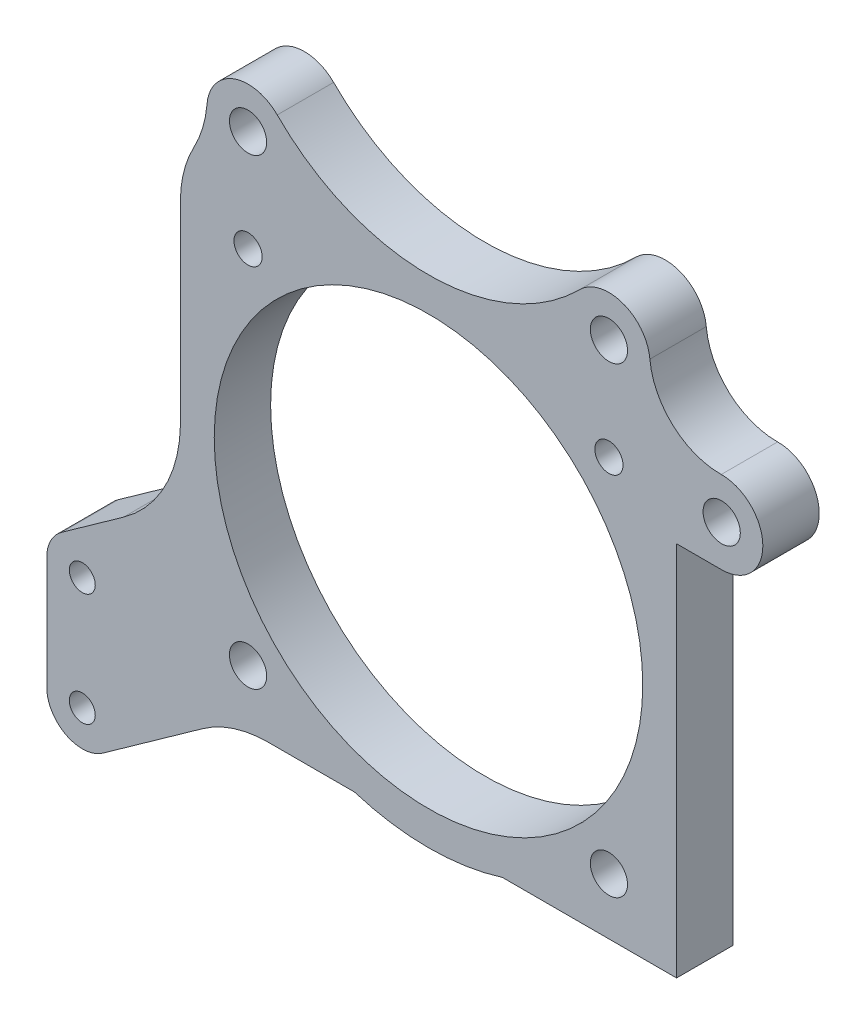
ISO-10303-21;
HEADER;
FILE_DESCRIPTION(('STEP AP214'),'2;1');
FILE_NAME('part.step','',(''),(''),'','','');
FILE_SCHEMA(('AUTOMOTIVE_DESIGN { 1 0 10303 214 1 1 1 1 }'));
ENDSEC;
DATA;
#1=APPLICATION_CONTEXT('core data for automotive mechanical design processes');
#2=APPLICATION_PROTOCOL_DEFINITION('international standard','automotive_design',2000,#1);
#3=PRODUCT_CONTEXT('',#1,'mechanical');
#4=PRODUCT('Part','Part','',(#3));
#5=PRODUCT_RELATED_PRODUCT_CATEGORY('part','',(#4));
#6=PRODUCT_DEFINITION_FORMATION('','',#4);
#7=PRODUCT_DEFINITION_CONTEXT('part definition',#1,'design');
#8=PRODUCT_DEFINITION('design','',#6,#7);
#9=PRODUCT_DEFINITION_SHAPE('','',#8);
#10=(LENGTH_UNIT() NAMED_UNIT(*) SI_UNIT(.MILLI.,.METRE.));
#11=(NAMED_UNIT(*) PLANE_ANGLE_UNIT() SI_UNIT($,.RADIAN.));
#12=(NAMED_UNIT(*) SI_UNIT($,.STERADIAN.) SOLID_ANGLE_UNIT());
#13=UNCERTAINTY_MEASURE_WITH_UNIT(LENGTH_MEASURE(1.E-05),#10,'distance_accuracy_value','');
#14=(GEOMETRIC_REPRESENTATION_CONTEXT(3) GLOBAL_UNCERTAINTY_ASSIGNED_CONTEXT((#13)) GLOBAL_UNIT_ASSIGNED_CONTEXT((#10,
#11,#12)) REPRESENTATION_CONTEXT('',''));
#15=CARTESIAN_POINT('',(0.,0.,0.));
#16=DIRECTION('',(0.,0.,1.));
#17=DIRECTION('',(1.,0.,0.));
#18=AXIS2_PLACEMENT_3D('',#15,#16,#17);
#19=CARTESIAN_POINT('',(-20.2380952380952,-21.,45.7173028644093));
#20=DIRECTION('',(-1.,0.,0.));
#21=DIRECTION('',(0.,0.,1.));
#22=AXIS2_PLACEMENT_3D('',#19,#20,#21);
#23=PLANE('',#22);
#24=DIRECTION('',(0.,1.,0.));
#25=VECTOR('',#24,1.);
#26=CARTESIAN_POINT('',(-20.2380952380952,-21.,0.));
#27=LINE('',#26,#25);
#28=CARTESIAN_POINT('',(-20.2380952380952,-0.558456175241286,0.));
#29=VERTEX_POINT('',#28);
#30=CARTESIAN_POINT('',(-20.2380952380952,16.6503890181125,0.));
#31=VERTEX_POINT('',#30);
#32=EDGE_CURVE('E258',#29,#31,#27,.T.);
#33=ORIENTED_EDGE('',*,*,#32,.F.);
#34=DIRECTION('',(0.,0.,1.));
#35=VECTOR('',#34,1.);
#36=CARTESIAN_POINT('',(-20.2380952380952,-0.558456175241278,-35.1845806434157));
#37=LINE('',#36,#35);
#38=CARTESIAN_POINT('',(-20.2380952380952,-0.558456175241278,5.));
#39=VERTEX_POINT('',#38);
#40=EDGE_CURVE('E58',#29,#39,#37,.T.);
#41=ORIENTED_EDGE('',*,*,#40,.T.);
#42=DIRECTION('',(0.,1.,0.));
#43=VECTOR('',#42,1.);
#44=CARTESIAN_POINT('',(-20.2380952380952,-21.,5.));
#45=LINE('',#44,#43);
#46=CARTESIAN_POINT('',(-20.2380952380952,16.6503890181126,5.));
#47=VERTEX_POINT('',#46);
#48=EDGE_CURVE('E260',#39,#47,#45,.T.);
#49=ORIENTED_EDGE('',*,*,#48,.T.);
#50=DIRECTION('',(0.,0.,-1.));
#51=VECTOR('',#50,1.);
#52=CARTESIAN_POINT('',(-20.2380952380952,16.6503890181126,0.));
#53=LINE('',#52,#51);
#54=EDGE_CURVE('E391',#47,#31,#53,.T.);
#55=ORIENTED_EDGE('',*,*,#54,.T.);
#56=EDGE_LOOP('',(#33,#41,#49,#55));
#57=FACE_BOUND('',#56,.T.);
#58=ADVANCED_FACE('F43',(#57),#23,.T.);
#59=CARTESIAN_POINT('',(-17.8880952380952,-21.,17.));
#60=DIRECTION('',(0.,1.,0.));
#61=DIRECTION('',(0.,0.,1.));
#62=AXIS2_PLACEMENT_3D('',#59,#60,#61);
#63=PLANE('',#62);
#64=DIRECTION('',(1.,0.,0.));
#65=VECTOR('',#64,1.);
#66=CARTESIAN_POINT('',(-17.8880952380952,-21.,5.));
#67=LINE('',#66,#65);
#68=CARTESIAN_POINT('',(-12.4460870876995,-21.,5.));
#69=VERTEX_POINT('',#68);
#70=CARTESIAN_POINT('',(-4.79553376239723,-21.,5.));
#71=VERTEX_POINT('',#70);
#72=EDGE_CURVE('E305',#69,#71,#67,.T.);
#73=ORIENTED_EDGE('',*,*,#72,.F.);
#74=DIRECTION('',(0.,0.,1.));
#75=VECTOR('',#74,1.);
#76=CARTESIAN_POINT('',(-12.4460870876995,-21.,-35.1845806434157));
#77=LINE('',#76,#75);
#78=CARTESIAN_POINT('',(-12.4460870876995,-21.,0.));
#79=VERTEX_POINT('',#78);
#80=EDGE_CURVE('E244',#79,#69,#77,.T.);
#81=ORIENTED_EDGE('',*,*,#80,.F.);
#82=DIRECTION('',(1.,0.,0.));
#83=VECTOR('',#82,1.);
#84=CARTESIAN_POINT('',(-17.8880952380952,-21.,0.));
#85=LINE('',#84,#83);
#86=CARTESIAN_POINT('',(-4.79553376239723,-21.,0.));
#87=VERTEX_POINT('',#86);
#88=EDGE_CURVE('E334',#79,#87,#85,.T.);
#89=ORIENTED_EDGE('',*,*,#88,.T.);
#90=DIRECTION('',(0.,0.,-1.));
#91=VECTOR('',#90,1.);
#92=CARTESIAN_POINT('',(-4.79553376239723,-21.,17.));
#93=LINE('',#92,#91);
#94=EDGE_CURVE('E380',#71,#87,#93,.T.);
#95=ORIENTED_EDGE('',*,*,#94,.F.);
#96=EDGE_LOOP('',(#73,#81,#89,#95));
#97=FACE_BOUND('',#96,.T.);
#98=ADVANCED_FACE('F455',(#97),#63,.F.);
#99=CARTESIAN_POINT('',(8.31934328620676,-21.,17.));
#100=DIRECTION('',(0.,1.,0.));
#101=DIRECTION('',(0.,0.,1.));
#102=AXIS2_PLACEMENT_3D('',#99,#100,#101);
#103=PLANE('',#102);
#104=DIRECTION('',(0.,0.,-1.));
#105=VECTOR('',#104,1.);
#106=CARTESIAN_POINT('',(23.7619047619048,-21.,17.));
#107=LINE('',#106,#105);
#108=CARTESIAN_POINT('',(23.7619047619048,-21.,5.));
#109=VERTEX_POINT('',#108);
#110=CARTESIAN_POINT('',(23.7619047619048,-21.,0.));
#111=VERTEX_POINT('',#110);
#112=EDGE_CURVE('E376',#109,#111,#107,.T.);
#113=ORIENTED_EDGE('',*,*,#112,.F.);
#114=DIRECTION('',(1.,0.,0.));
#115=VECTOR('',#114,1.);
#116=CARTESIAN_POINT('',(8.31934328620676,-21.,5.));
#117=LINE('',#116,#115);
#118=CARTESIAN_POINT('',(8.31934328620676,-21.,5.));
#119=VERTEX_POINT('',#118);
#120=EDGE_CURVE('E301',#119,#109,#117,.T.);
#121=ORIENTED_EDGE('',*,*,#120,.F.);
#122=DIRECTION('',(0.,0.,-1.));
#123=VECTOR('',#122,1.);
#124=CARTESIAN_POINT('',(8.31934328620676,-21.,17.));
#125=LINE('',#124,#123);
#126=CARTESIAN_POINT('',(8.31934328620676,-21.,0.));
#127=VERTEX_POINT('',#126);
#128=EDGE_CURVE('E378',#119,#127,#125,.T.);
#129=ORIENTED_EDGE('',*,*,#128,.T.);
#130=DIRECTION('',(1.,0.,0.));
#131=VECTOR('',#130,1.);
#132=CARTESIAN_POINT('',(8.31934328620676,-21.,0.));
#133=LINE('',#132,#131);
#134=EDGE_CURVE('E340',#127,#111,#133,.T.);
#135=ORIENTED_EDGE('',*,*,#134,.T.);
#136=EDGE_LOOP('',(#113,#121,#129,#135));
#137=FACE_BOUND('',#136,.T.);
#138=ADVANCED_FACE('F446',(#137),#103,.F.);
#139=CARTESIAN_POINT('',(23.7619047619048,-21.,17.));
#140=DIRECTION('',(-1.,0.,0.));
#141=DIRECTION('',(0.,-1.,0.));
#142=AXIS2_PLACEMENT_3D('',#139,#140,#141);
#143=PLANE('',#142);
#144=DIRECTION('',(0.,1.,0.));
#145=VECTOR('',#144,1.);
#146=CARTESIAN_POINT('',(23.7619047619048,-21.,5.));
#147=LINE('',#146,#145);
#148=CARTESIAN_POINT('',(23.7619047619048,12.35,5.));
#149=VERTEX_POINT('',#148);
#150=EDGE_CURVE('E262',#109,#149,#147,.T.);
#151=ORIENTED_EDGE('',*,*,#150,.F.);
#152=ORIENTED_EDGE('',*,*,#112,.T.);
#153=DIRECTION('',(0.,1.,0.));
#154=VECTOR('',#153,1.);
#155=CARTESIAN_POINT('',(23.7619047619048,-21.,0.));
#156=LINE('',#155,#154);
#157=CARTESIAN_POINT('',(23.7619047619048,12.35,0.));
#158=VERTEX_POINT('',#157);
#159=EDGE_CURVE('E343',#111,#158,#156,.T.);
#160=ORIENTED_EDGE('',*,*,#159,.T.);
#161=DIRECTION('',(0.,0.,-1.));
#162=VECTOR('',#161,1.);
#163=CARTESIAN_POINT('',(23.7619047619048,12.35,17.));
#164=LINE('',#163,#162);
#165=EDGE_CURVE('E374',#149,#158,#164,.T.);
#166=ORIENTED_EDGE('',*,*,#165,.F.);
#167=EDGE_LOOP('',(#151,#152,#160,#166));
#168=FACE_BOUND('',#167,.T.);
#169=ADVANCED_FACE('F442',(#168),#143,.F.);
#170=CARTESIAN_POINT('',(1.76190476190476,0.,17.));
#171=DIRECTION('',(0.,0.,-1.));
#172=DIRECTION('',(-1.,0.,0.));
#173=AXIS2_PLACEMENT_3D('',#170,#171,#172);
#174=CYLINDRICAL_SURFACE('',#173,22.);
#175=CARTESIAN_POINT('',(1.76190476190476,0.,5.));
#176=DIRECTION('',(0.,0.,1.));
#177=DIRECTION('',(1.,0.,0.));
#178=AXIS2_PLACEMENT_3D('',#175,#176,#177);
#179=CIRCLE('',#178,22.);
#180=EDGE_CURVE('E303',#71,#119,#179,.T.);
#181=ORIENTED_EDGE('',*,*,#180,.F.);
#182=ORIENTED_EDGE('',*,*,#94,.T.);
#183=CARTESIAN_POINT('',(1.76190476190476,0.,0.));
#184=DIRECTION('',(0.,0.,1.));
#185=DIRECTION('',(1.,0.,0.));
#186=AXIS2_PLACEMENT_3D('',#183,#184,#185);
#187=CIRCLE('',#186,22.);
#188=EDGE_CURVE('E337',#87,#127,#187,.T.);
#189=ORIENTED_EDGE('',*,*,#188,.T.);
#190=ORIENTED_EDGE('',*,*,#128,.F.);
#191=EDGE_LOOP('',(#181,#182,#189,#190));
#192=FACE_BOUND('',#191,.T.);
#193=ADVANCED_FACE('F451',(#192),#174,.T.);
#194=CARTESIAN_POINT('',(23.7619047619048,12.35,17.));
#195=DIRECTION('',(0.,1.,0.));
#196=DIRECTION('',(0.,0.,1.));
#197=AXIS2_PLACEMENT_3D('',#194,#195,#196);
#198=PLANE('',#197);
#199=DIRECTION('',(1.,0.,0.));
#200=VECTOR('',#199,1.);
#201=CARTESIAN_POINT('',(23.7619047619048,12.35,5.));
#202=LINE('',#201,#200);
#203=CARTESIAN_POINT('',(27.7619047619048,12.35,5.));
#204=VERTEX_POINT('',#203);
#205=EDGE_CURVE('E299',#149,#204,#202,.T.);
#206=ORIENTED_EDGE('',*,*,#205,.F.);
#207=ORIENTED_EDGE('',*,*,#165,.T.);
#208=DIRECTION('',(1.,0.,0.));
#209=VECTOR('',#208,1.);
#210=CARTESIAN_POINT('',(23.7619047619048,12.35,0.));
#211=LINE('',#210,#209);
#212=CARTESIAN_POINT('',(27.7619047619048,12.35,0.));
#213=VERTEX_POINT('',#212);
#214=EDGE_CURVE('E346',#158,#213,#211,.T.);
#215=ORIENTED_EDGE('',*,*,#214,.T.);
#216=DIRECTION('',(0.,0.,-1.));
#217=VECTOR('',#216,1.);
#218=CARTESIAN_POINT('',(27.7619047619048,12.35,17.));
#219=LINE('',#218,#217);
#220=EDGE_CURVE('E372',#204,#213,#219,.T.);
#221=ORIENTED_EDGE('',*,*,#220,.F.);
#222=EDGE_LOOP('',(#206,#207,#215,#221));
#223=FACE_BOUND('',#222,.T.);
#224=ADVANCED_FACE('F438',(#223),#198,.F.);
#225=CARTESIAN_POINT('',(27.7619047619048,16.,17.));
#226=DIRECTION('',(0.,0.,-1.));
#227=DIRECTION('',(-1.,0.,0.));
#228=AXIS2_PLACEMENT_3D('',#225,#226,#227);
#229=CYLINDRICAL_SURFACE('',#228,3.65);
#230=CARTESIAN_POINT('',(27.7619047619048,16.,5.));
#231=DIRECTION('',(0.,0.,1.));
#232=DIRECTION('',(1.,0.,0.));
#233=AXIS2_PLACEMENT_3D('',#230,#231,#232);
#234=CIRCLE('',#233,3.65);
#235=CARTESIAN_POINT('',(27.7228519117956,19.6497910727737,5.));
#236=VERTEX_POINT('',#235);
#237=EDGE_CURVE('E297',#204,#236,#234,.T.);
#238=ORIENTED_EDGE('',*,*,#237,.F.);
#239=ORIENTED_EDGE('',*,*,#220,.T.);
#240=CARTESIAN_POINT('',(27.7619047619048,16.,0.));
#241=DIRECTION('',(0.,0.,1.));
#242=DIRECTION('',(-1.,0.,0.));
#243=AXIS2_PLACEMENT_3D('',#240,#241,#242);
#244=CIRCLE('',#243,3.65);
#245=CARTESIAN_POINT('',(27.7228519117956,19.6497910727737,0.));
#246=VERTEX_POINT('',#245);
#247=EDGE_CURVE('E349',#213,#246,#244,.T.);
#248=ORIENTED_EDGE('',*,*,#247,.T.);
#249=DIRECTION('',(0.,0.,-1.));
#250=VECTOR('',#249,1.);
#251=CARTESIAN_POINT('',(27.7228519117956,19.6497910727737,17.));
#252=LINE('',#251,#250);
#253=EDGE_CURVE('E370',#236,#246,#252,.T.);
#254=ORIENTED_EDGE('',*,*,#253,.F.);
#255=EDGE_LOOP('',(#238,#239,#248,#254));
#256=FACE_BOUND('',#255,.T.);
#257=ADVANCED_FACE('F431',(#256),#229,.T.);
#258=CARTESIAN_POINT('',(27.6555742361179,25.9374105269034,17.));
#259=DIRECTION('',(0.,0.,-1.));
#260=DIRECTION('',(-1.,0.,0.));
#261=AXIS2_PLACEMENT_3D('',#258,#259,#260);
#262=CYLINDRICAL_SURFACE('',#261,6.28797938018214);
#263=DIRECTION('',(0.,0.,-1.));
#264=VECTOR('',#263,1.);
#265=CARTESIAN_POINT('',(21.3956307135696,25.3442901511771,17.));
#266=LINE('',#265,#264);
#267=CARTESIAN_POINT('',(21.3956307135696,25.3442901511771,5.));
#268=VERTEX_POINT('',#267);
#269=CARTESIAN_POINT('',(21.3956307135696,25.3442901511771,0.));
#270=VERTEX_POINT('',#269);
#271=EDGE_CURVE('E368',#268,#270,#266,.T.);
#272=ORIENTED_EDGE('',*,*,#271,.F.);
#273=CARTESIAN_POINT('',(27.6555742361179,25.9374105269034,5.));
#274=DIRECTION('',(0.,0.,1.));
#275=DIRECTION('',(1.,0.,0.));
#276=AXIS2_PLACEMENT_3D('',#273,#274,#275);
#277=CIRCLE('',#276,6.28797938018214);
#278=EDGE_CURVE('E295',#236,#268,#277,.F.);
#279=ORIENTED_EDGE('',*,*,#278,.F.);
#280=ORIENTED_EDGE('',*,*,#253,.T.);
#281=CARTESIAN_POINT('',(27.6555742361179,25.9374105269034,0.));
#282=DIRECTION('',(0.,0.,-1.));
#283=DIRECTION('',(-1.,0.,0.));
#284=AXIS2_PLACEMENT_3D('',#281,#282,#283);
#285=CIRCLE('',#284,6.28797938018214);
#286=EDGE_CURVE('E352',#246,#270,#285,.T.);
#287=ORIENTED_EDGE('',*,*,#286,.T.);
#288=EDGE_LOOP('',(#272,#279,#280,#287));
#289=FACE_BOUND('',#288,.T.);
#290=ADVANCED_FACE('F427',(#289),#262,.F.);
#291=CARTESIAN_POINT('',(17.7619047619048,25.,17.));
#292=DIRECTION('',(0.,0.,-1.));
#293=DIRECTION('',(-1.,0.,0.));
#294=AXIS2_PLACEMENT_3D('',#291,#292,#293);
#295=CYLINDRICAL_SURFACE('',#294,3.65);
#296=CARTESIAN_POINT('',(17.7619047619048,25.,5.));
#297=DIRECTION('',(0.,0.,1.));
#298=DIRECTION('',(1.,0.,0.));
#299=AXIS2_PLACEMENT_3D('',#296,#297,#298);
#300=CIRCLE('',#299,3.65);
#301=CARTESIAN_POINT('',(15.1747568965716,27.5747166684709,5.));
#302=VERTEX_POINT('',#301);
#303=EDGE_CURVE('E293',#268,#302,#300,.T.);
#304=ORIENTED_EDGE('',*,*,#303,.F.);
#305=ORIENTED_EDGE('',*,*,#271,.T.);
#306=CARTESIAN_POINT('',(17.7619047619048,25.,0.));
#307=DIRECTION('',(0.,0.,1.));
#308=DIRECTION('',(-1.,0.,0.));
#309=AXIS2_PLACEMENT_3D('',#306,#307,#308);
#310=CIRCLE('',#309,3.65);
#311=CARTESIAN_POINT('',(15.1747568965716,27.5747166684709,0.));
#312=VERTEX_POINT('',#311);
#313=EDGE_CURVE('E355',#270,#312,#310,.T.);
#314=ORIENTED_EDGE('',*,*,#313,.T.);
#315=DIRECTION('',(0.,0.,-1.));
#316=VECTOR('',#315,1.);
#317=CARTESIAN_POINT('',(15.1747568965716,27.5747166684709,17.));
#318=LINE('',#317,#316);
#319=EDGE_CURVE('E366',#302,#312,#318,.T.);
#320=ORIENTED_EDGE('',*,*,#319,.F.);
#321=EDGE_LOOP('',(#304,#305,#314,#320));
#322=FACE_BOUND('',#321,.T.);
#323=ADVANCED_FACE('F423',(#322),#295,.T.);
#324=CARTESIAN_POINT('',(1.76190476190476,40.9231203007519,17.));
#325=DIRECTION('',(0.,0.,-1.));
#326=DIRECTION('',(-1.,0.,0.));
#327=AXIS2_PLACEMENT_3D('',#324,#325,#326);
#328=CYLINDRICAL_SURFACE('',#327,18.9231203007519);
#329=CARTESIAN_POINT('',(1.76190476190476,40.9231203007519,5.));
#330=DIRECTION('',(0.,0.,1.));
#331=DIRECTION('',(1.,0.,0.));
#332=AXIS2_PLACEMENT_3D('',#329,#330,#331);
#333=CIRCLE('',#332,18.9231203007519);
#334=CARTESIAN_POINT('',(-11.650947372762,27.5747166684709,5.));
#335=VERTEX_POINT('',#334);
#336=EDGE_CURVE('E291',#302,#335,#333,.F.);
#337=ORIENTED_EDGE('',*,*,#336,.F.);
#338=ORIENTED_EDGE('',*,*,#319,.T.);
#339=CARTESIAN_POINT('',(1.76190476190476,40.9231203007519,0.));
#340=DIRECTION('',(0.,0.,-1.));
#341=DIRECTION('',(-1.,0.,0.));
#342=AXIS2_PLACEMENT_3D('',#339,#340,#341);
#343=CIRCLE('',#342,18.9231203007519);
#344=CARTESIAN_POINT('',(-11.650947372762,27.5747166684709,0.));
#345=VERTEX_POINT('',#344);
#346=EDGE_CURVE('E358',#312,#345,#343,.T.);
#347=ORIENTED_EDGE('',*,*,#346,.T.);
#348=DIRECTION('',(0.,0.,-1.));
#349=VECTOR('',#348,1.);
#350=CARTESIAN_POINT('',(-11.650947372762,27.5747166684709,17.));
#351=LINE('',#350,#349);
#352=EDGE_CURVE('E364',#335,#345,#351,.T.);
#353=ORIENTED_EDGE('',*,*,#352,.F.);
#354=EDGE_LOOP('',(#337,#338,#347,#353));
#355=FACE_BOUND('',#354,.T.);
#356=ADVANCED_FACE('F415',(#355),#328,.F.);
#357=CARTESIAN_POINT('',(-14.2380952380952,25.,17.));
#358=DIRECTION('',(0.,0.,-1.));
#359=DIRECTION('',(-1.,0.,0.));
#360=AXIS2_PLACEMENT_3D('',#357,#358,#359);
#361=CYLINDRICAL_SURFACE('',#360,3.65);
#362=CARTESIAN_POINT('',(-14.2380952380952,25.,0.));
#363=DIRECTION('',(0.,0.,1.));
#364=DIRECTION('',(-1.,0.,0.));
#365=AXIS2_PLACEMENT_3D('',#362,#363,#364);
#366=CIRCLE('',#365,3.65);
#367=CARTESIAN_POINT('',(-17.8751950900905,25.3066018046526,0.));
#368=VERTEX_POINT('',#367);
#369=EDGE_CURVE('E361',#345,#368,#366,.T.);
#370=ORIENTED_EDGE('',*,*,#369,.T.);
#371=DIRECTION('',(0.,0.,-1.));
#372=VECTOR('',#371,1.);
#373=CARTESIAN_POINT('',(-17.8751950900905,25.3066018046526,17.));
#374=LINE('',#373,#372);
#375=CARTESIAN_POINT('',(-17.8751950900905,25.3066018046526,5.));
#376=VERTEX_POINT('',#375);
#377=EDGE_CURVE('E383',#368,#376,#374,.F.);
#378=ORIENTED_EDGE('',*,*,#377,.T.);
#379=CARTESIAN_POINT('',(-14.2380952380952,25.,5.));
#380=DIRECTION('',(0.,0.,1.));
#381=DIRECTION('',(1.,0.,0.));
#382=AXIS2_PLACEMENT_3D('',#379,#380,#381);
#383=CIRCLE('',#382,3.65);
#384=EDGE_CURVE('E288',#335,#376,#383,.T.);
#385=ORIENTED_EDGE('',*,*,#384,.F.);
#386=ORIENTED_EDGE('',*,*,#352,.T.);
#387=EDGE_LOOP('',(#370,#378,#385,#386));
#388=FACE_BOUND('',#387,.T.);
#389=ADVANCED_FACE('F413',(#388),#361,.T.);
#390=CARTESIAN_POINT('',(1.76190476190476,0.,17.));
#391=DIRECTION('',(0.,0.,-1.));
#392=DIRECTION('',(-1.,0.,0.));
#393=AXIS2_PLACEMENT_3D('',#390,#391,#392);
#394=CYLINDRICAL_SURFACE('',#393,19.);
#395=CARTESIAN_POINT('',(1.76190476190476,0.,0.));
#396=DIRECTION('',(0.,0.,1.));
#397=DIRECTION('',(1.,0.,0.));
#398=AXIS2_PLACEMENT_3D('',#395,#396,#397);
#399=CIRCLE('',#398,19.);
#400=CARTESIAN_POINT('',(20.7619047619048,0.,0.));
#401=VERTEX_POINT('',#400);
#402=EDGE_CURVE('E330',#401,#401,#399,.T.);
#403=ORIENTED_EDGE('',*,*,#402,.F.);
#404=EDGE_LOOP('',(#403));
#405=FACE_BOUND('',#404,.T.);
#406=CARTESIAN_POINT('',(1.76190476190476,0.,5.));
#407=DIRECTION('',(0.,0.,1.));
#408=DIRECTION('',(1.,0.,0.));
#409=AXIS2_PLACEMENT_3D('',#406,#407,#408);
#410=CIRCLE('',#409,19.);
#411=CARTESIAN_POINT('',(20.7619047619048,0.,5.));
#412=VERTEX_POINT('',#411);
#413=EDGE_CURVE('E284',#412,#412,#410,.T.);
#414=ORIENTED_EDGE('',*,*,#413,.T.);
#415=EDGE_LOOP('',(#414));
#416=FACE_BOUND('',#415,.T.);
#417=ADVANCED_FACE('F628',(#405,#416),#394,.F.);
#418=CARTESIAN_POINT('',(17.7619047619048,16.,17.));
#419=DIRECTION('',(0.,0.,-1.));
#420=DIRECTION('',(-1.,0.,0.));
#421=AXIS2_PLACEMENT_3D('',#418,#419,#420);
#422=CYLINDRICAL_SURFACE('',#421,1.25);
#423=CARTESIAN_POINT('',(17.7619047619048,16.,0.));
#424=DIRECTION('',(0.,0.,1.));
#425=DIRECTION('',(1.,0.,0.));
#426=AXIS2_PLACEMENT_3D('',#423,#424,#425);
#427=CIRCLE('',#426,1.25);
#428=CARTESIAN_POINT('',(19.0119047619048,16.,0.));
#429=VERTEX_POINT('',#428);
#430=EDGE_CURVE('E327',#429,#429,#427,.T.);
#431=ORIENTED_EDGE('',*,*,#430,.F.);
#432=EDGE_LOOP('',(#431));
#433=FACE_BOUND('',#432,.T.);
#434=CARTESIAN_POINT('',(17.7619047619048,16.,5.));
#435=DIRECTION('',(0.,0.,1.));
#436=DIRECTION('',(1.,0.,0.));
#437=AXIS2_PLACEMENT_3D('',#434,#435,#436);
#438=CIRCLE('',#437,1.25);
#439=CARTESIAN_POINT('',(19.0119047619048,16.,5.));
#440=VERTEX_POINT('',#439);
#441=EDGE_CURVE('E281',#440,#440,#438,.T.);
#442=ORIENTED_EDGE('',*,*,#441,.T.);
#443=EDGE_LOOP('',(#442));
#444=FACE_BOUND('',#443,.T.);
#445=ADVANCED_FACE('F639',(#433,#444),#422,.F.);
#446=CARTESIAN_POINT('',(-14.2380952380952,16.,17.));
#447=DIRECTION('',(0.,0.,-1.));
#448=DIRECTION('',(-1.,0.,0.));
#449=AXIS2_PLACEMENT_3D('',#446,#447,#448);
#450=CYLINDRICAL_SURFACE('',#449,1.25);
#451=CARTESIAN_POINT('',(-14.2380952380952,16.,0.));
#452=DIRECTION('',(0.,0.,1.));
#453=DIRECTION('',(1.,0.,0.));
#454=AXIS2_PLACEMENT_3D('',#451,#452,#453);
#455=CIRCLE('',#454,1.25);
#456=CARTESIAN_POINT('',(-12.9880952380952,16.,0.));
#457=VERTEX_POINT('',#456);
#458=EDGE_CURVE('E324',#457,#457,#455,.T.);
#459=ORIENTED_EDGE('',*,*,#458,.F.);
#460=EDGE_LOOP('',(#459));
#461=FACE_BOUND('',#460,.T.);
#462=CARTESIAN_POINT('',(-14.2380952380952,16.,5.));
#463=DIRECTION('',(0.,0.,1.));
#464=DIRECTION('',(1.,0.,0.));
#465=AXIS2_PLACEMENT_3D('',#462,#463,#464);
#466=CIRCLE('',#465,1.25);
#467=CARTESIAN_POINT('',(-12.9880952380952,16.,5.));
#468=VERTEX_POINT('',#467);
#469=EDGE_CURVE('E278',#468,#468,#466,.T.);
#470=ORIENTED_EDGE('',*,*,#469,.T.);
#471=EDGE_LOOP('',(#470));
#472=FACE_BOUND('',#471,.T.);
#473=ADVANCED_FACE('F730',(#461,#472),#450,.F.);
#474=CARTESIAN_POINT('',(-14.2380952380952,-16.,17.));
#475=DIRECTION('',(0.,0.,-1.));
#476=DIRECTION('',(-1.,0.,0.));
#477=AXIS2_PLACEMENT_3D('',#474,#475,#476);
#478=CYLINDRICAL_SURFACE('',#477,1.65);
#479=CARTESIAN_POINT('',(-14.2380952380952,-16.,0.));
#480=DIRECTION('',(0.,0.,1.));
#481=DIRECTION('',(1.,0.,0.));
#482=AXIS2_PLACEMENT_3D('',#479,#480,#481);
#483=CIRCLE('',#482,1.65);
#484=CARTESIAN_POINT('',(-12.5880952380952,-16.,0.));
#485=VERTEX_POINT('',#484);
#486=EDGE_CURVE('E320',#485,#485,#483,.T.);
#487=ORIENTED_EDGE('',*,*,#486,.F.);
#488=EDGE_LOOP('',(#487));
#489=FACE_BOUND('',#488,.T.);
#490=CARTESIAN_POINT('',(-14.2380952380952,-16.,5.));
#491=DIRECTION('',(0.,0.,1.));
#492=DIRECTION('',(1.,0.,0.));
#493=AXIS2_PLACEMENT_3D('',#490,#491,#492);
#494=CIRCLE('',#493,1.65);
#495=CARTESIAN_POINT('',(-12.5880952380952,-16.,5.));
#496=VERTEX_POINT('',#495);
#497=EDGE_CURVE('E274',#496,#496,#494,.T.);
#498=ORIENTED_EDGE('',*,*,#497,.T.);
#499=EDGE_LOOP('',(#498));
#500=FACE_BOUND('',#499,.T.);
#501=ADVANCED_FACE('F720',(#489,#500),#478,.F.);
#502=CARTESIAN_POINT('',(17.7619047619048,-16.,17.));
#503=DIRECTION('',(0.,0.,-1.));
#504=DIRECTION('',(-1.,0.,0.));
#505=AXIS2_PLACEMENT_3D('',#502,#503,#504);
#506=CYLINDRICAL_SURFACE('',#505,1.65);
#507=CARTESIAN_POINT('',(17.7619047619048,-16.,0.));
#508=DIRECTION('',(0.,0.,1.));
#509=DIRECTION('',(1.,0.,0.));
#510=AXIS2_PLACEMENT_3D('',#507,#508,#509);
#511=CIRCLE('',#510,1.65);
#512=CARTESIAN_POINT('',(19.4119047619048,-16.,0.));
#513=VERTEX_POINT('',#512);
#514=EDGE_CURVE('E317',#513,#513,#511,.T.);
#515=ORIENTED_EDGE('',*,*,#514,.F.);
#516=EDGE_LOOP('',(#515));
#517=FACE_BOUND('',#516,.T.);
#518=CARTESIAN_POINT('',(17.7619047619048,-16.,5.));
#519=DIRECTION('',(0.,0.,1.));
#520=DIRECTION('',(1.,0.,0.));
#521=AXIS2_PLACEMENT_3D('',#518,#519,#520);
#522=CIRCLE('',#521,1.65);
#523=CARTESIAN_POINT('',(19.4119047619048,-16.,5.));
#524=VERTEX_POINT('',#523);
#525=EDGE_CURVE('E271',#524,#524,#522,.T.);
#526=ORIENTED_EDGE('',*,*,#525,.T.);
#527=EDGE_LOOP('',(#526));
#528=FACE_BOUND('',#527,.T.);
#529=ADVANCED_FACE('F710',(#517,#528),#506,.F.);
#530=CARTESIAN_POINT('',(27.7619047619048,16.,17.));
#531=DIRECTION('',(0.,0.,-1.));
#532=DIRECTION('',(-1.,0.,0.));
#533=AXIS2_PLACEMENT_3D('',#530,#531,#532);
#534=CYLINDRICAL_SURFACE('',#533,1.65);
#535=CARTESIAN_POINT('',(27.7619047619048,16.,0.));
#536=DIRECTION('',(0.,0.,1.));
#537=DIRECTION('',(-1.,0.,0.));
#538=AXIS2_PLACEMENT_3D('',#535,#536,#537);
#539=CIRCLE('',#538,1.65);
#540=CARTESIAN_POINT('',(26.1119047619048,16.,0.));
#541=VERTEX_POINT('',#540);
#542=EDGE_CURVE('E314',#541,#541,#539,.T.);
#543=ORIENTED_EDGE('',*,*,#542,.F.);
#544=EDGE_LOOP('',(#543));
#545=FACE_BOUND('',#544,.T.);
#546=CARTESIAN_POINT('',(27.7619047619048,16.,5.));
#547=DIRECTION('',(0.,0.,1.));
#548=DIRECTION('',(1.,0.,0.));
#549=AXIS2_PLACEMENT_3D('',#546,#547,#548);
#550=CIRCLE('',#549,1.65);
#551=CARTESIAN_POINT('',(29.4119047619048,16.,5.));
#552=VERTEX_POINT('',#551);
#553=EDGE_CURVE('E268',#552,#552,#550,.T.);
#554=ORIENTED_EDGE('',*,*,#553,.T.);
#555=EDGE_LOOP('',(#554));
#556=FACE_BOUND('',#555,.T.);
#557=ADVANCED_FACE('F700',(#545,#556),#534,.F.);
#558=CARTESIAN_POINT('',(17.7619047619048,25.,17.));
#559=DIRECTION('',(0.,0.,-1.));
#560=DIRECTION('',(-1.,0.,0.));
#561=AXIS2_PLACEMENT_3D('',#558,#559,#560);
#562=CYLINDRICAL_SURFACE('',#561,1.65);
#563=CARTESIAN_POINT('',(17.7619047619048,25.,0.));
#564=DIRECTION('',(0.,0.,1.));
#565=DIRECTION('',(-1.,0.,0.));
#566=AXIS2_PLACEMENT_3D('',#563,#564,#565);
#567=CIRCLE('',#566,1.65);
#568=CARTESIAN_POINT('',(16.1119047619048,25.,0.));
#569=VERTEX_POINT('',#568);
#570=EDGE_CURVE('E311',#569,#569,#567,.T.);
#571=ORIENTED_EDGE('',*,*,#570,.F.);
#572=EDGE_LOOP('',(#571));
#573=FACE_BOUND('',#572,.T.);
#574=CARTESIAN_POINT('',(17.7619047619048,25.,5.));
#575=DIRECTION('',(0.,0.,1.));
#576=DIRECTION('',(1.,0.,0.));
#577=AXIS2_PLACEMENT_3D('',#574,#575,#576);
#578=CIRCLE('',#577,1.65);
#579=CARTESIAN_POINT('',(19.4119047619048,25.,5.));
#580=VERTEX_POINT('',#579);
#581=EDGE_CURVE('E265',#580,#580,#578,.T.);
#582=ORIENTED_EDGE('',*,*,#581,.T.);
#583=EDGE_LOOP('',(#582));
#584=FACE_BOUND('',#583,.T.);
#585=ADVANCED_FACE('F691',(#573,#584),#562,.F.);
#586=CARTESIAN_POINT('',(-14.2380952380952,25.,17.));
#587=DIRECTION('',(0.,0.,-1.));
#588=DIRECTION('',(-1.,0.,0.));
#589=AXIS2_PLACEMENT_3D('',#586,#587,#588);
#590=CYLINDRICAL_SURFACE('',#589,1.65);
#591=CARTESIAN_POINT('',(-14.2380952380952,25.,0.));
#592=DIRECTION('',(0.,0.,1.));
#593=DIRECTION('',(-1.,0.,0.));
#594=AXIS2_PLACEMENT_3D('',#591,#592,#593);
#595=CIRCLE('',#594,1.65);
#596=CARTESIAN_POINT('',(-15.8880952380952,25.,0.));
#597=VERTEX_POINT('',#596);
#598=EDGE_CURVE('E308',#597,#597,#595,.T.);
#599=ORIENTED_EDGE('',*,*,#598,.F.);
#600=EDGE_LOOP('',(#599));
#601=FACE_BOUND('',#600,.T.);
#602=CARTESIAN_POINT('',(-14.2380952380952,25.,5.));
#603=DIRECTION('',(0.,0.,1.));
#604=DIRECTION('',(1.,0.,0.));
#605=AXIS2_PLACEMENT_3D('',#602,#603,#604);
#606=CIRCLE('',#605,1.65);
#607=CARTESIAN_POINT('',(-12.5880952380952,25.,5.));
#608=VERTEX_POINT('',#607);
#609=EDGE_CURVE('E264',#608,#608,#606,.T.);
#610=ORIENTED_EDGE('',*,*,#609,.T.);
#611=EDGE_LOOP('',(#610));
#612=FACE_BOUND('',#611,.T.);
#613=ADVANCED_FACE('F490',(#601,#612),#590,.F.);
#614=CARTESIAN_POINT('',(1.76190476190476,0.,0.));
#615=DIRECTION('',(0.,0.,1.));
#616=DIRECTION('',(1.,0.,0.));
#617=AXIS2_PLACEMENT_3D('',#614,#615,#616);
#618=PLANE('',#617);
#619=ORIENTED_EDGE('',*,*,#88,.F.);
#620=CARTESIAN_POINT('',(-12.4460870876995,-31.,0.));
#621=DIRECTION('',(0.,0.,1.));
#622=DIRECTION('',(1.,0.,0.));
#623=AXIS2_PLACEMENT_3D('',#620,#621,#622);
#624=CIRCLE('',#623,10.);
#625=CARTESIAN_POINT('',(-18.2463287097038,-22.8540072964451,0.));
#626=VERTEX_POINT('',#625);
#627=EDGE_CURVE('E200',#79,#626,#624,.T.);
#628=ORIENTED_EDGE('',*,*,#627,.T.);
#629=DIRECTION('',(-0.81459927035549,-0.580024162200424,0.));
#630=VECTOR('',#629,1.);
#631=CARTESIAN_POINT('',(4.65965087242825,-6.54412082833158,0.));
#632=LINE('',#631,#630);
#633=CARTESIAN_POINT('',(-27.1110191271639,-29.1659877016198,0.));
#634=VERTEX_POINT('',#633);
#635=EDGE_CURVE('E193',#626,#634,#632,.T.);
#636=ORIENTED_EDGE('',*,*,#635,.T.);
#637=CARTESIAN_POINT('',(-28.9380952380952,-26.6,0.));
#638=DIRECTION('',(0.,0.,1.));
#639=DIRECTION('',(1.,0.,0.));
#640=AXIS2_PLACEMENT_3D('',#637,#638,#639);
#641=CIRCLE('',#640,3.15);
#642=CARTESIAN_POINT('',(-32.0880952380952,-26.6,0.));
#643=VERTEX_POINT('',#642);
#644=EDGE_CURVE('E198',#634,#643,#641,.F.);
#645=ORIENTED_EDGE('',*,*,#644,.T.);
#646=DIRECTION('',(0.,1.,0.));
#647=VECTOR('',#646,1.);
#648=CARTESIAN_POINT('',(-32.0880952380952,0.,0.));
#649=LINE('',#648,#647);
#650=CARTESIAN_POINT('',(-32.0880952380952,-16.6,0.));
#651=VERTEX_POINT('',#650);
#652=EDGE_CURVE('E215',#643,#651,#649,.T.);
#653=ORIENTED_EDGE('',*,*,#652,.T.);
#654=CARTESIAN_POINT('',(-28.9380952380952,-16.6,0.));
#655=DIRECTION('',(0.,0.,1.));
#656=DIRECTION('',(1.,0.,0.));
#657=AXIS2_PLACEMENT_3D('',#654,#655,#656);
#658=CIRCLE('',#657,3.15);
#659=CARTESIAN_POINT('',(-30.7651713490266,-14.0340122983802,0.));
#660=VERTEX_POINT('',#659);
#661=EDGE_CURVE('E250',#651,#660,#658,.F.);
#662=ORIENTED_EDGE('',*,*,#661,.T.);
#663=DIRECTION('',(0.81459927035549,0.580024162200424,0.));
#664=VECTOR('',#663,1.);
#665=CARTESIAN_POINT('',(-3.71937394260461,5.22357428754495,0.));
#666=LINE('',#665,#664);
#667=CARTESIAN_POINT('',(-25.2760003473441,-10.1255238829213,0.));
#668=VERTEX_POINT('',#667);
#669=EDGE_CURVE('E253',#660,#668,#666,.T.);
#670=ORIENTED_EDGE('',*,*,#669,.T.);
#671=CARTESIAN_POINT('',(-32.2362902937492,-0.350332638655394,0.));
#672=DIRECTION('',(0.,0.,1.));
#673=DIRECTION('',(1.,0.,0.));
#674=AXIS2_PLACEMENT_3D('',#671,#672,#673);
#675=CIRCLE('',#674,12.);
#676=EDGE_CURVE('E237',#29,#668,#675,.F.);
#677=ORIENTED_EDGE('',*,*,#676,.F.);
#678=ORIENTED_EDGE('',*,*,#32,.T.);
#679=CARTESIAN_POINT('',(-10.2380952380952,16.6503890181126,0.));
#680=DIRECTION('',(0.,0.,1.));
#681=DIRECTION('',(1.,0.,0.));
#682=AXIS2_PLACEMENT_3D('',#679,#680,#681);
#683=CIRCLE('',#682,10.);
#684=CARTESIAN_POINT('',(-19.0389737284699,21.3984978835095,0.));
#685=VERTEX_POINT('',#684);
#686=EDGE_CURVE('E394',#31,#685,#683,.F.);
#687=ORIENTED_EDGE('',*,*,#686,.T.);
#688=CARTESIAN_POINT('',(-27.8398522188445,26.1466067489064,0.));
#689=DIRECTION('',(0.,0.,1.));
#690=DIRECTION('',(1.,0.,0.));
#691=AXIS2_PLACEMENT_3D('',#688,#689,#690);
#692=CIRCLE('',#691,10.);
#693=EDGE_CURVE('E387',#685,#368,#692,.T.);
#694=ORIENTED_EDGE('',*,*,#693,.T.);
#695=ORIENTED_EDGE('',*,*,#369,.F.);
#696=ORIENTED_EDGE('',*,*,#346,.F.);
#697=ORIENTED_EDGE('',*,*,#313,.F.);
#698=ORIENTED_EDGE('',*,*,#286,.F.);
#699=ORIENTED_EDGE('',*,*,#247,.F.);
#700=ORIENTED_EDGE('',*,*,#214,.F.);
#701=ORIENTED_EDGE('',*,*,#159,.F.);
#702=ORIENTED_EDGE('',*,*,#134,.F.);
#703=ORIENTED_EDGE('',*,*,#188,.F.);
#704=EDGE_LOOP('',(#619,#628,#636,#645,#653,#662,#670,#677,#678,#687,#694,#695,#696,#697,#698,
#699,#700,#701,#702,#703));
#705=FACE_BOUND('',#704,.T.);
#706=ORIENTED_EDGE('',*,*,#570,.T.);
#707=EDGE_LOOP('',(#706));
#708=FACE_BOUND('',#707,.T.);
#709=ORIENTED_EDGE('',*,*,#514,.T.);
#710=EDGE_LOOP('',(#709));
#711=FACE_BOUND('',#710,.T.);
#712=ORIENTED_EDGE('',*,*,#458,.T.);
#713=EDGE_LOOP('',(#712));
#714=FACE_BOUND('',#713,.T.);
#715=ORIENTED_EDGE('',*,*,#402,.T.);
#716=EDGE_LOOP('',(#715));
#717=FACE_BOUND('',#716,.T.);
#718=ORIENTED_EDGE('',*,*,#430,.T.);
#719=EDGE_LOOP('',(#718));
#720=FACE_BOUND('',#719,.T.);
#721=ORIENTED_EDGE('',*,*,#486,.T.);
#722=EDGE_LOOP('',(#721));
#723=FACE_BOUND('',#722,.T.);
#724=ORIENTED_EDGE('',*,*,#542,.T.);
#725=EDGE_LOOP('',(#724));
#726=FACE_BOUND('',#725,.T.);
#727=ORIENTED_EDGE('',*,*,#598,.T.);
#728=EDGE_LOOP('',(#727));
#729=FACE_BOUND('',#728,.T.);
#730=CARTESIAN_POINT('',(-28.9380952380952,-16.6,0.));
#731=DIRECTION('',(0.,0.,1.));
#732=DIRECTION('',(1.,0.,0.));
#733=AXIS2_PLACEMENT_3D('',#730,#731,#732);
#734=CIRCLE('',#733,1.15);
#735=CARTESIAN_POINT('',(-27.7880952380952,-16.6,0.));
#736=VERTEX_POINT('',#735);
#737=EDGE_CURVE('E476',#736,#736,#734,.F.);
#738=ORIENTED_EDGE('',*,*,#737,.F.);
#739=EDGE_LOOP('',(#738));
#740=FACE_BOUND('',#739,.T.);
#741=CARTESIAN_POINT('',(-28.9380952380952,-26.6,0.));
#742=DIRECTION('',(0.,0.,1.));
#743=DIRECTION('',(1.,0.,0.));
#744=AXIS2_PLACEMENT_3D('',#741,#742,#743);
#745=CIRCLE('',#744,1.15);
#746=CARTESIAN_POINT('',(-27.7880952380952,-26.6,0.));
#747=VERTEX_POINT('',#746);
#748=EDGE_CURVE('E243',#747,#747,#745,.F.);
#749=ORIENTED_EDGE('',*,*,#748,.F.);
#750=EDGE_LOOP('',(#749));
#751=FACE_BOUND('',#750,.T.);
#752=ADVANCED_FACE('F196',(#705,#708,#711,#714,#717,#720,#723,#726,#729,#740,#751),#618,.F.);
#753=CARTESIAN_POINT('',(0.,0.,5.));
#754=DIRECTION('',(0.,0.,1.));
#755=DIRECTION('',(1.,0.,0.));
#756=AXIS2_PLACEMENT_3D('',#753,#754,#755);
#757=PLANE('',#756);
#758=CARTESIAN_POINT('',(-12.4460870876995,-31.,5.));
#759=DIRECTION('',(0.,0.,1.));
#760=DIRECTION('',(1.,0.,0.));
#761=AXIS2_PLACEMENT_3D('',#758,#759,#760);
#762=CIRCLE('',#761,10.);
#763=CARTESIAN_POINT('',(-18.2463287097038,-22.8540072964451,5.));
#764=VERTEX_POINT('',#763);
#765=EDGE_CURVE('E460',#764,#69,#762,.F.);
#766=ORIENTED_EDGE('',*,*,#765,.T.);
#767=ORIENTED_EDGE('',*,*,#72,.T.);
#768=ORIENTED_EDGE('',*,*,#180,.T.);
#769=ORIENTED_EDGE('',*,*,#120,.T.);
#770=ORIENTED_EDGE('',*,*,#150,.T.);
#771=ORIENTED_EDGE('',*,*,#205,.T.);
#772=ORIENTED_EDGE('',*,*,#237,.T.);
#773=ORIENTED_EDGE('',*,*,#278,.T.);
#774=ORIENTED_EDGE('',*,*,#303,.T.);
#775=ORIENTED_EDGE('',*,*,#336,.T.);
#776=ORIENTED_EDGE('',*,*,#384,.T.);
#777=CARTESIAN_POINT('',(-27.8398522188445,26.1466067489064,5.));
#778=DIRECTION('',(0.,0.,1.));
#779=DIRECTION('',(1.,0.,0.));
#780=AXIS2_PLACEMENT_3D('',#777,#778,#779);
#781=CIRCLE('',#780,10.);
#782=CARTESIAN_POINT('',(-19.0389737284699,21.3984978835095,5.));
#783=VERTEX_POINT('',#782);
#784=EDGE_CURVE('E389',#376,#783,#781,.F.);
#785=ORIENTED_EDGE('',*,*,#784,.T.);
#786=CARTESIAN_POINT('',(-10.2380952380952,16.6503890181126,5.));
#787=DIRECTION('',(0.,0.,1.));
#788=DIRECTION('',(1.,0.,0.));
#789=AXIS2_PLACEMENT_3D('',#786,#787,#788);
#790=CIRCLE('',#789,10.);
#791=EDGE_CURVE('E11',#783,#47,#790,.T.);
#792=ORIENTED_EDGE('',*,*,#791,.T.);
#793=ORIENTED_EDGE('',*,*,#48,.F.);
#794=CARTESIAN_POINT('',(-32.2362902937492,-0.350332638655394,5.));
#795=DIRECTION('',(0.,0.,1.));
#796=DIRECTION('',(1.,0.,0.));
#797=AXIS2_PLACEMENT_3D('',#794,#795,#796);
#798=CIRCLE('',#797,12.);
#799=CARTESIAN_POINT('',(-25.2760003473441,-10.1255238829213,5.));
#800=VERTEX_POINT('',#799);
#801=EDGE_CURVE('E241',#800,#39,#798,.T.);
#802=ORIENTED_EDGE('',*,*,#801,.F.);
#803=DIRECTION('',(-0.81459927035549,-0.580024162200424,0.));
#804=VECTOR('',#803,1.);
#805=CARTESIAN_POINT('',(-3.71937394260461,5.22357428754495,5.));
#806=LINE('',#805,#804);
#807=CARTESIAN_POINT('',(-30.7651713490266,-14.0340122983802,5.));
#808=VERTEX_POINT('',#807);
#809=EDGE_CURVE('E462',#800,#808,#806,.T.);
#810=ORIENTED_EDGE('',*,*,#809,.T.);
#811=CARTESIAN_POINT('',(-28.9380952380952,-16.6,5.));
#812=DIRECTION('',(0.,0.,1.));
#813=DIRECTION('',(1.,0.,0.));
#814=AXIS2_PLACEMENT_3D('',#811,#812,#813);
#815=CIRCLE('',#814,3.15);
#816=CARTESIAN_POINT('',(-32.0880952380952,-16.6,5.));
#817=VERTEX_POINT('',#816);
#818=EDGE_CURVE('E466',#808,#817,#815,.T.);
#819=ORIENTED_EDGE('',*,*,#818,.T.);
#820=DIRECTION('',(0.,-1.,0.));
#821=VECTOR('',#820,1.);
#822=CARTESIAN_POINT('',(-32.0880952380952,0.,5.));
#823=LINE('',#822,#821);
#824=CARTESIAN_POINT('',(-32.0880952380952,-26.6,5.));
#825=VERTEX_POINT('',#824);
#826=EDGE_CURVE('E858',#817,#825,#823,.T.);
#827=ORIENTED_EDGE('',*,*,#826,.T.);
#828=CARTESIAN_POINT('',(-28.9380952380952,-26.6,5.));
#829=DIRECTION('',(0.,0.,1.));
#830=DIRECTION('',(1.,0.,0.));
#831=AXIS2_PLACEMENT_3D('',#828,#829,#830);
#832=CIRCLE('',#831,3.15);
#833=CARTESIAN_POINT('',(-27.1110191271639,-29.1659877016198,5.));
#834=VERTEX_POINT('',#833);
#835=EDGE_CURVE('E205',#825,#834,#832,.T.);
#836=ORIENTED_EDGE('',*,*,#835,.T.);
#837=DIRECTION('',(0.81459927035549,0.580024162200424,0.));
#838=VECTOR('',#837,1.);
#839=CARTESIAN_POINT('',(4.65965087242825,-6.54412082833158,5.));
#840=LINE('',#839,#838);
#841=EDGE_CURVE('E219',#834,#764,#840,.T.);
#842=ORIENTED_EDGE('',*,*,#841,.T.);
#843=EDGE_LOOP('',(#766,#767,#768,#769,#770,#771,#772,#773,#774,#775,#776,#785,#792,#793,#802,
#810,#819,#827,#836,#842));
#844=FACE_BOUND('',#843,.T.);
#845=ORIENTED_EDGE('',*,*,#413,.F.);
#846=EDGE_LOOP('',(#845));
#847=FACE_BOUND('',#846,.T.);
#848=ORIENTED_EDGE('',*,*,#441,.F.);
#849=EDGE_LOOP('',(#848));
#850=FACE_BOUND('',#849,.T.);
#851=ORIENTED_EDGE('',*,*,#469,.F.);
#852=EDGE_LOOP('',(#851));
#853=FACE_BOUND('',#852,.T.);
#854=ORIENTED_EDGE('',*,*,#497,.F.);
#855=EDGE_LOOP('',(#854));
#856=FACE_BOUND('',#855,.T.);
#857=ORIENTED_EDGE('',*,*,#525,.F.);
#858=EDGE_LOOP('',(#857));
#859=FACE_BOUND('',#858,.T.);
#860=ORIENTED_EDGE('',*,*,#581,.F.);
#861=EDGE_LOOP('',(#860));
#862=FACE_BOUND('',#861,.T.);
#863=ORIENTED_EDGE('',*,*,#609,.F.);
#864=EDGE_LOOP('',(#863));
#865=FACE_BOUND('',#864,.T.);
#866=ORIENTED_EDGE('',*,*,#553,.F.);
#867=EDGE_LOOP('',(#866));
#868=FACE_BOUND('',#867,.T.);
#869=CARTESIAN_POINT('',(-28.9380952380952,-16.6,5.));
#870=DIRECTION('',(0.,0.,1.));
#871=DIRECTION('',(1.,0.,0.));
#872=AXIS2_PLACEMENT_3D('',#869,#870,#871);
#873=CIRCLE('',#872,1.15);
#874=CARTESIAN_POINT('',(-27.7880952380952,-16.6,5.));
#875=VERTEX_POINT('',#874);
#876=EDGE_CURVE('E246',#875,#875,#873,.T.);
#877=ORIENTED_EDGE('',*,*,#876,.F.);
#878=EDGE_LOOP('',(#877));
#879=FACE_BOUND('',#878,.T.);
#880=CARTESIAN_POINT('',(-28.9380952380952,-26.6,5.));
#881=DIRECTION('',(0.,0.,1.));
#882=DIRECTION('',(1.,0.,0.));
#883=AXIS2_PLACEMENT_3D('',#880,#881,#882);
#884=CIRCLE('',#883,1.15);
#885=CARTESIAN_POINT('',(-27.7880952380952,-26.6,5.));
#886=VERTEX_POINT('',#885);
#887=EDGE_CURVE('E472',#886,#886,#884,.T.);
#888=ORIENTED_EDGE('',*,*,#887,.F.);
#889=EDGE_LOOP('',(#888));
#890=FACE_BOUND('',#889,.T.);
#891=ADVANCED_FACE('F406',(#844,#847,#850,#853,#856,#859,#862,#865,#868,#879,#890),#757,.T.);
#892=CARTESIAN_POINT('',(-27.8398522188445,26.1466067489064,17.));
#893=DIRECTION('',(0.,0.,1.));
#894=DIRECTION('',(1.,0.,0.));
#895=AXIS2_PLACEMENT_3D('',#892,#893,#894);
#896=CYLINDRICAL_SURFACE('',#895,10.);
#897=ORIENTED_EDGE('',*,*,#693,.F.);
#898=DIRECTION('',(0.,0.,1.));
#899=VECTOR('',#898,1.);
#900=CARTESIAN_POINT('',(-19.0389737284699,21.3984978835095,17.));
#901=LINE('',#900,#899);
#902=EDGE_CURVE('E51',#685,#783,#901,.T.);
#903=ORIENTED_EDGE('',*,*,#902,.T.);
#904=ORIENTED_EDGE('',*,*,#784,.F.);
#905=ORIENTED_EDGE('',*,*,#377,.F.);
#906=EDGE_LOOP('',(#897,#903,#904,#905));
#907=FACE_BOUND('',#906,.T.);
#908=ADVANCED_FACE('F401',(#907),#896,.F.);
#909=CARTESIAN_POINT('',(-10.2380952380952,16.6503890181126,17.));
#910=DIRECTION('',(0.,0.,1.));
#911=DIRECTION('',(1.,0.,0.));
#912=AXIS2_PLACEMENT_3D('',#909,#910,#911);
#913=CYLINDRICAL_SURFACE('',#912,10.);
#914=ORIENTED_EDGE('',*,*,#791,.F.);
#915=ORIENTED_EDGE('',*,*,#902,.F.);
#916=ORIENTED_EDGE('',*,*,#686,.F.);
#917=ORIENTED_EDGE('',*,*,#54,.F.);
#918=EDGE_LOOP('',(#914,#915,#916,#917));
#919=FACE_BOUND('',#918,.T.);
#920=ADVANCED_FACE('F45',(#919),#913,.T.);
#921=CARTESIAN_POINT('',(4.65965087242825,-6.54412082833158,-35.1845806434157));
#922=DIRECTION('',(0.580024162200424,-0.814599270355489,0.));
#923=DIRECTION('',(0.81459927035549,0.580024162200424,0.));
#924=AXIS2_PLACEMENT_3D('',#921,#922,#923);
#925=PLANE('',#924);
#926=ORIENTED_EDGE('',*,*,#635,.F.);
#927=DIRECTION('',(0.,0.,1.));
#928=VECTOR('',#927,1.);
#929=CARTESIAN_POINT('',(-18.2463287097038,-22.8540072964451,-35.1845806434157));
#930=LINE('',#929,#928);
#931=EDGE_CURVE('E222',#626,#764,#930,.T.);
#932=ORIENTED_EDGE('',*,*,#931,.T.);
#933=ORIENTED_EDGE('',*,*,#841,.F.);
#934=DIRECTION('',(0.,0.,1.));
#935=VECTOR('',#934,1.);
#936=CARTESIAN_POINT('',(-27.1110191271639,-29.1659877016198,-35.1845806434157));
#937=LINE('',#936,#935);
#938=EDGE_CURVE('E211',#634,#834,#937,.T.);
#939=ORIENTED_EDGE('',*,*,#938,.F.);
#940=EDGE_LOOP('',(#926,#932,#933,#939));
#941=FACE_BOUND('',#940,.T.);
#942=ADVANCED_FACE('F217',(#941),#925,.T.);
#943=CARTESIAN_POINT('',(-28.9380952380952,-26.6,-35.1845806434157));
#944=DIRECTION('',(0.,0.,1.));
#945=DIRECTION('',(1.,0.,0.));
#946=AXIS2_PLACEMENT_3D('',#943,#944,#945);
#947=CYLINDRICAL_SURFACE('',#946,3.15);
#948=ORIENTED_EDGE('',*,*,#644,.F.);
#949=ORIENTED_EDGE('',*,*,#938,.T.);
#950=ORIENTED_EDGE('',*,*,#835,.F.);
#951=DIRECTION('',(0.,0.,1.));
#952=VECTOR('',#951,1.);
#953=CARTESIAN_POINT('',(-32.0880952380952,-26.6,-35.1845806434157));
#954=LINE('',#953,#952);
#955=EDGE_CURVE('E213',#643,#825,#954,.T.);
#956=ORIENTED_EDGE('',*,*,#955,.F.);
#957=EDGE_LOOP('',(#948,#949,#950,#956));
#958=FACE_BOUND('',#957,.T.);
#959=ADVANCED_FACE('F209',(#958),#947,.T.);
#960=CARTESIAN_POINT('',(-32.0880952380952,0.,-35.1845806434157));
#961=DIRECTION('',(-1.,0.,0.));
#962=DIRECTION('',(0.,0.,1.));
#963=AXIS2_PLACEMENT_3D('',#960,#961,#962);
#964=PLANE('',#963);
#965=ORIENTED_EDGE('',*,*,#652,.F.);
#966=ORIENTED_EDGE('',*,*,#955,.T.);
#967=ORIENTED_EDGE('',*,*,#826,.F.);
#968=DIRECTION('',(0.,0.,1.));
#969=VECTOR('',#968,1.);
#970=CARTESIAN_POINT('',(-32.0880952380952,-16.6,-35.1845806434157));
#971=LINE('',#970,#969);
#972=EDGE_CURVE('E226',#651,#817,#971,.T.);
#973=ORIENTED_EDGE('',*,*,#972,.F.);
#974=EDGE_LOOP('',(#965,#966,#967,#973));
#975=FACE_BOUND('',#974,.T.);
#976=ADVANCED_FACE('F519',(#975),#964,.T.);
#977=CARTESIAN_POINT('',(-28.9380952380952,-16.6,-35.1845806434157));
#978=DIRECTION('',(0.,0.,1.));
#979=DIRECTION('',(1.,0.,0.));
#980=AXIS2_PLACEMENT_3D('',#977,#978,#979);
#981=CYLINDRICAL_SURFACE('',#980,3.15);
#982=ORIENTED_EDGE('',*,*,#661,.F.);
#983=ORIENTED_EDGE('',*,*,#972,.T.);
#984=ORIENTED_EDGE('',*,*,#818,.F.);
#985=DIRECTION('',(0.,0.,1.));
#986=VECTOR('',#985,1.);
#987=CARTESIAN_POINT('',(-30.7651713490266,-14.0340122983802,-35.1845806434157));
#988=LINE('',#987,#986);
#989=EDGE_CURVE('E235',#660,#808,#988,.T.);
#990=ORIENTED_EDGE('',*,*,#989,.F.);
#991=EDGE_LOOP('',(#982,#983,#984,#990));
#992=FACE_BOUND('',#991,.T.);
#993=ADVANCED_FACE('F522',(#992),#981,.T.);
#994=CARTESIAN_POINT('',(-3.71937394260461,5.22357428754495,-35.1845806434157));
#995=DIRECTION('',(-0.580024162200424,0.81459927035549,0.));
#996=DIRECTION('',(-0.81459927035549,-0.580024162200424,0.));
#997=AXIS2_PLACEMENT_3D('',#994,#995,#996);
#998=PLANE('',#997);
#999=ORIENTED_EDGE('',*,*,#669,.F.);
#1000=ORIENTED_EDGE('',*,*,#989,.T.);
#1001=ORIENTED_EDGE('',*,*,#809,.F.);
#1002=DIRECTION('',(0.,0.,1.));
#1003=VECTOR('',#1002,1.);
#1004=CARTESIAN_POINT('',(-25.2760003473441,-10.1255238829213,-35.1845806434157));
#1005=LINE('',#1004,#1003);
#1006=EDGE_CURVE('E238',#668,#800,#1005,.T.);
#1007=ORIENTED_EDGE('',*,*,#1006,.F.);
#1008=EDGE_LOOP('',(#999,#1000,#1001,#1007));
#1009=FACE_BOUND('',#1008,.T.);
#1010=ADVANCED_FACE('F526',(#1009),#998,.T.);
#1011=CARTESIAN_POINT('',(-32.2362902937492,-0.350332638655394,-35.1845806434157));
#1012=DIRECTION('',(0.,0.,1.));
#1013=DIRECTION('',(1.,0.,0.));
#1014=AXIS2_PLACEMENT_3D('',#1011,#1012,#1013);
#1015=CYLINDRICAL_SURFACE('',#1014,12.);
#1016=ORIENTED_EDGE('',*,*,#40,.F.);
#1017=ORIENTED_EDGE('',*,*,#676,.T.);
#1018=ORIENTED_EDGE('',*,*,#1006,.T.);
#1019=ORIENTED_EDGE('',*,*,#801,.T.);
#1020=EDGE_LOOP('',(#1016,#1017,#1018,#1019));
#1021=FACE_BOUND('',#1020,.T.);
#1022=ADVANCED_FACE('F497',(#1021),#1015,.F.);
#1023=CARTESIAN_POINT('',(-28.9380952380952,-26.6,-35.1845806434157));
#1024=DIRECTION('',(0.,0.,1.));
#1025=DIRECTION('',(1.,0.,0.));
#1026=AXIS2_PLACEMENT_3D('',#1023,#1024,#1025);
#1027=CYLINDRICAL_SURFACE('',#1026,1.15);
#1028=ORIENTED_EDGE('',*,*,#748,.T.);
#1029=EDGE_LOOP('',(#1028));
#1030=FACE_BOUND('',#1029,.T.);
#1031=ORIENTED_EDGE('',*,*,#887,.T.);
#1032=EDGE_LOOP('',(#1031));
#1033=FACE_BOUND('',#1032,.T.);
#1034=ADVANCED_FACE('F494',(#1030,#1033),#1027,.F.);
#1035=CARTESIAN_POINT('',(-28.9380952380952,-16.6,-35.1845806434157));
#1036=DIRECTION('',(0.,0.,1.));
#1037=DIRECTION('',(1.,0.,0.));
#1038=AXIS2_PLACEMENT_3D('',#1035,#1036,#1037);
#1039=CYLINDRICAL_SURFACE('',#1038,1.15);
#1040=ORIENTED_EDGE('',*,*,#737,.T.);
#1041=EDGE_LOOP('',(#1040));
#1042=FACE_BOUND('',#1041,.T.);
#1043=ORIENTED_EDGE('',*,*,#876,.T.);
#1044=EDGE_LOOP('',(#1043));
#1045=FACE_BOUND('',#1044,.T.);
#1046=ADVANCED_FACE('F485',(#1042,#1045),#1039,.F.);
#1047=CARTESIAN_POINT('',(-12.4460870876995,-31.,-35.1845806434157));
#1048=DIRECTION('',(0.,0.,1.));
#1049=DIRECTION('',(1.,0.,0.));
#1050=AXIS2_PLACEMENT_3D('',#1047,#1048,#1049);
#1051=CYLINDRICAL_SURFACE('',#1050,10.);
#1052=ORIENTED_EDGE('',*,*,#627,.F.);
#1053=ORIENTED_EDGE('',*,*,#80,.T.);
#1054=ORIENTED_EDGE('',*,*,#765,.F.);
#1055=ORIENTED_EDGE('',*,*,#931,.F.);
#1056=EDGE_LOOP('',(#1052,#1053,#1054,#1055));
#1057=FACE_BOUND('',#1056,.T.);
#1058=ADVANCED_FACE('F459',(#1057),#1051,.F.);
#1059=CLOSED_SHELL('',(#58,#98,#138,#169,#193,#224,#257,#290,#323,#356,#389,#417,#445,#473,#501,
#529,#557,#585,#613,#752,#891,#908,#920,#942,#959,#976,#993,#1010,#1022,#1034,#1046,#1058));
#1060=MANIFOLD_SOLID_BREP('B2',#1059);
#1061=ADVANCED_BREP_SHAPE_REPRESENTATION('',(#18,#1060),#14);
#1062=SHAPE_DEFINITION_REPRESENTATION(#9,#1061);
ENDSEC;
END-ISO-10303-21;
